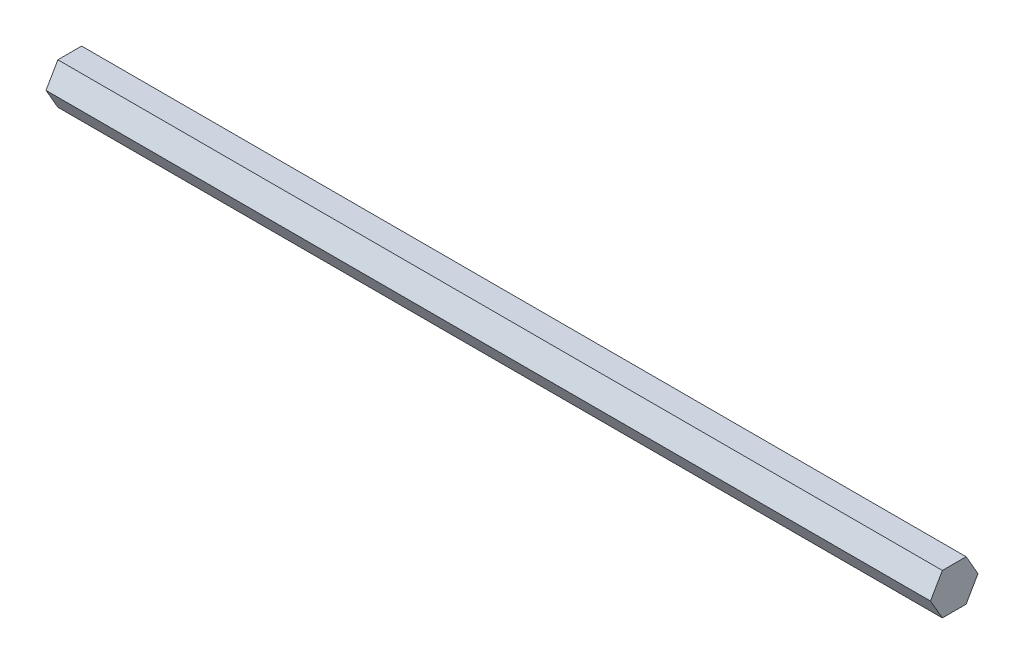
ISO-10303-21;
HEADER;
FILE_DESCRIPTION(('STEP AP214'),'2;1');
FILE_NAME('part.step','',(''),(''),'','','');
FILE_SCHEMA(('AUTOMOTIVE_DESIGN { 1 0 10303 214 1 1 1 1 }'));
ENDSEC;
DATA;
#1=APPLICATION_CONTEXT('core data for automotive mechanical design processes');
#2=APPLICATION_PROTOCOL_DEFINITION('international standard','automotive_design',2000,#1);
#3=PRODUCT_CONTEXT('',#1,'mechanical');
#4=PRODUCT('Part','Part','',(#3));
#5=PRODUCT_RELATED_PRODUCT_CATEGORY('part','',(#4));
#6=PRODUCT_DEFINITION_FORMATION('','',#4);
#7=PRODUCT_DEFINITION_CONTEXT('part definition',#1,'design');
#8=PRODUCT_DEFINITION('design','',#6,#7);
#9=PRODUCT_DEFINITION_SHAPE('','',#8);
#10=(LENGTH_UNIT() NAMED_UNIT(*) SI_UNIT(.MILLI.,.METRE.));
#11=(NAMED_UNIT(*) PLANE_ANGLE_UNIT() SI_UNIT($,.RADIAN.));
#12=(NAMED_UNIT(*) SI_UNIT($,.STERADIAN.) SOLID_ANGLE_UNIT());
#13=UNCERTAINTY_MEASURE_WITH_UNIT(LENGTH_MEASURE(1.E-05),#10,'distance_accuracy_value','');
#14=(GEOMETRIC_REPRESENTATION_CONTEXT(3) GLOBAL_UNCERTAINTY_ASSIGNED_CONTEXT((#13)) GLOBAL_UNIT_ASSIGNED_CONTEXT((#10,
#11,#12)) REPRESENTATION_CONTEXT('',''));
#15=CARTESIAN_POINT('',(0.,0.,0.));
#16=DIRECTION('',(0.,0.,1.));
#17=DIRECTION('',(1.,0.,0.));
#18=AXIS2_PLACEMENT_3D('',#15,#16,#17);
#19=CARTESIAN_POINT('',(273.05,-6.34999999999996,-3.6661742093542));
#20=DIRECTION('',(0.,0.499999999999995,0.866025403784442));
#21=DIRECTION('',(0.,-0.866025403784442,0.499999999999995));
#22=AXIS2_PLACEMENT_3D('',#19,#20,#21);
#23=PLANE('',#22);
#24=DIRECTION('',(0.,0.866025403784442,-0.499999999999995));
#25=VECTOR('',#24,1.);
#26=CARTESIAN_POINT('',(0.,-6.34999999999996,-3.6661742093542));
#27=LINE('',#26,#25);
#28=CARTESIAN_POINT('',(0.,-6.34999999999996,-3.6661742093542));
#29=VERTEX_POINT('',#28);
#30=CARTESIAN_POINT('',(0.,0.,-7.33234841870825));
#31=VERTEX_POINT('',#30);
#32=EDGE_CURVE('E123',#29,#31,#27,.T.);
#33=ORIENTED_EDGE('',*,*,#32,.T.);
#34=DIRECTION('',(-1.,0.,0.));
#35=VECTOR('',#34,1.);
#36=CARTESIAN_POINT('',(273.05,0.,-7.33234841870825));
#37=LINE('',#36,#35);
#38=CARTESIAN_POINT('',(273.05,0.,-7.33234841870825));
#39=VERTEX_POINT('',#38);
#40=EDGE_CURVE('E11',#39,#31,#37,.T.);
#41=ORIENTED_EDGE('',*,*,#40,.F.);
#42=DIRECTION('',(0.,0.866025403784442,-0.499999999999995));
#43=VECTOR('',#42,1.);
#44=CARTESIAN_POINT('',(273.05,-6.34999999999996,-3.6661742093542));
#45=LINE('',#44,#43);
#46=CARTESIAN_POINT('',(273.05,-6.34999999999996,-3.6661742093542));
#47=VERTEX_POINT('',#46);
#48=EDGE_CURVE('E133',#47,#39,#45,.T.);
#49=ORIENTED_EDGE('',*,*,#48,.F.);
#50=DIRECTION('',(-1.,0.,0.));
#51=VECTOR('',#50,1.);
#52=CARTESIAN_POINT('',(273.05,-6.34999999999996,-3.6661742093542));
#53=LINE('',#52,#51);
#54=EDGE_CURVE('E119',#47,#29,#53,.T.);
#55=ORIENTED_EDGE('',*,*,#54,.T.);
#56=EDGE_LOOP('',(#33,#41,#49,#55));
#57=FACE_BOUND('',#56,.T.);
#58=ADVANCED_FACE('F39',(#57),#23,.F.);
#59=CARTESIAN_POINT('',(273.05,0.,-7.33234841870825));
#60=DIRECTION('',(0.,-0.500000000000001,0.866025403784438));
#61=DIRECTION('',(0.,-0.866025403784438,-0.500000000000001));
#62=AXIS2_PLACEMENT_3D('',#59,#60,#61);
#63=PLANE('',#62);
#64=DIRECTION('',(0.,0.866025403784438,0.500000000000001));
#65=VECTOR('',#64,1.);
#66=CARTESIAN_POINT('',(0.,0.,-7.33234841870825));
#67=LINE('',#66,#65);
#68=CARTESIAN_POINT('',(0.,6.35000000000001,-3.66617420935411));
#69=VERTEX_POINT('',#68);
#70=EDGE_CURVE('E126',#31,#69,#67,.T.);
#71=ORIENTED_EDGE('',*,*,#70,.T.);
#72=DIRECTION('',(-1.,0.,0.));
#73=VECTOR('',#72,1.);
#74=CARTESIAN_POINT('',(273.05,6.35000000000001,-3.66617420935411));
#75=LINE('',#74,#73);
#76=CARTESIAN_POINT('',(273.05,6.35000000000001,-3.66617420935411));
#77=VERTEX_POINT('',#76);
#78=EDGE_CURVE('E47',#77,#69,#75,.T.);
#79=ORIENTED_EDGE('',*,*,#78,.F.);
#80=DIRECTION('',(0.,0.866025403784438,0.500000000000001));
#81=VECTOR('',#80,1.);
#82=CARTESIAN_POINT('',(273.05,0.,-7.33234841870825));
#83=LINE('',#82,#81);
#84=EDGE_CURVE('E92',#39,#77,#83,.T.);
#85=ORIENTED_EDGE('',*,*,#84,.F.);
#86=ORIENTED_EDGE('',*,*,#40,.T.);
#87=EDGE_LOOP('',(#71,#79,#85,#86));
#88=FACE_BOUND('',#87,.T.);
#89=ADVANCED_FACE('F157',(#88),#63,.F.);
#90=CARTESIAN_POINT('',(273.05,6.35000000000001,-3.66617420935411));
#91=DIRECTION('',(0.,-1.,0.));
#92=DIRECTION('',(0.,0.,-1.));
#93=AXIS2_PLACEMENT_3D('',#90,#91,#92);
#94=PLANE('',#93);
#95=DIRECTION('',(0.,0.,1.));
#96=VECTOR('',#95,1.);
#97=CARTESIAN_POINT('',(0.,6.35000000000001,-3.66617420935411));
#98=LINE('',#97,#96);
#99=CARTESIAN_POINT('',(0.,6.34999999999999,3.66617420935415));
#100=VERTEX_POINT('',#99);
#101=EDGE_CURVE('E128',#69,#100,#98,.T.);
#102=ORIENTED_EDGE('',*,*,#101,.T.);
#103=DIRECTION('',(-1.,0.,0.));
#104=VECTOR('',#103,1.);
#105=CARTESIAN_POINT('',(273.05,6.34999999999999,3.66617420935415));
#106=LINE('',#105,#104);
#107=CARTESIAN_POINT('',(273.05,6.34999999999999,3.66617420935415));
#108=VERTEX_POINT('',#107);
#109=EDGE_CURVE('E114',#108,#100,#106,.T.);
#110=ORIENTED_EDGE('',*,*,#109,.F.);
#111=DIRECTION('',(0.,0.,1.));
#112=VECTOR('',#111,1.);
#113=CARTESIAN_POINT('',(273.05,6.35000000000001,-3.66617420935411));
#114=LINE('',#113,#112);
#115=EDGE_CURVE('E105',#77,#108,#114,.T.);
#116=ORIENTED_EDGE('',*,*,#115,.F.);
#117=ORIENTED_EDGE('',*,*,#78,.T.);
#118=EDGE_LOOP('',(#102,#110,#116,#117));
#119=FACE_BOUND('',#118,.T.);
#120=ADVANCED_FACE('F139',(#119),#94,.F.);
#121=CARTESIAN_POINT('',(273.05,6.34999999999999,3.66617420935415));
#122=DIRECTION('',(0.,-0.499999999999995,-0.866025403784442));
#123=DIRECTION('',(0.,0.866025403784442,-0.499999999999995));
#124=AXIS2_PLACEMENT_3D('',#121,#122,#123);
#125=PLANE('',#124);
#126=DIRECTION('',(0.,-0.866025403784442,0.499999999999995));
#127=VECTOR('',#126,1.);
#128=CARTESIAN_POINT('',(0.,6.34999999999999,3.66617420935415));
#129=LINE('',#128,#127);
#130=CARTESIAN_POINT('',(0.,0.,7.33234841870825));
#131=VERTEX_POINT('',#130);
#132=EDGE_CURVE('E113',#100,#131,#129,.T.);
#133=ORIENTED_EDGE('',*,*,#132,.T.);
#134=DIRECTION('',(-1.,0.,0.));
#135=VECTOR('',#134,1.);
#136=CARTESIAN_POINT('',(273.05,0.,7.33234841870825));
#137=LINE('',#136,#135);
#138=CARTESIAN_POINT('',(273.05,0.,7.33234841870825));
#139=VERTEX_POINT('',#138);
#140=EDGE_CURVE('E110',#139,#131,#137,.T.);
#141=ORIENTED_EDGE('',*,*,#140,.F.);
#142=DIRECTION('',(0.,-0.866025403784442,0.499999999999995));
#143=VECTOR('',#142,1.);
#144=CARTESIAN_POINT('',(273.05,6.34999999999999,3.66617420935415));
#145=LINE('',#144,#143);
#146=EDGE_CURVE('E99',#108,#139,#145,.T.);
#147=ORIENTED_EDGE('',*,*,#146,.F.);
#148=ORIENTED_EDGE('',*,*,#109,.T.);
#149=EDGE_LOOP('',(#133,#141,#147,#148));
#150=FACE_BOUND('',#149,.T.);
#151=ADVANCED_FACE('F111',(#150),#125,.F.);
#152=CARTESIAN_POINT('',(273.05,0.,7.33234841870825));
#153=DIRECTION('',(0.,0.500000000000007,-0.866025403784435));
#154=DIRECTION('',(0.,0.866025403784435,0.500000000000007));
#155=AXIS2_PLACEMENT_3D('',#152,#153,#154);
#156=PLANE('',#155);
#157=DIRECTION('',(0.,-0.866025403784434,-0.500000000000007));
#158=VECTOR('',#157,1.);
#159=CARTESIAN_POINT('',(0.,0.,7.33234841870825));
#160=LINE('',#159,#158);
#161=CARTESIAN_POINT('',(0.,-6.35000000000004,3.66617420935407));
#162=VERTEX_POINT('',#161);
#163=EDGE_CURVE('E78',#131,#162,#160,.T.);
#164=ORIENTED_EDGE('',*,*,#163,.T.);
#165=DIRECTION('',(-1.,0.,0.));
#166=VECTOR('',#165,1.);
#167=CARTESIAN_POINT('',(273.05,-6.35000000000004,3.66617420935407));
#168=LINE('',#167,#166);
#169=CARTESIAN_POINT('',(273.05,-6.35000000000004,3.66617420935407));
#170=VERTEX_POINT('',#169);
#171=EDGE_CURVE('E115',#170,#162,#168,.T.);
#172=ORIENTED_EDGE('',*,*,#171,.F.);
#173=DIRECTION('',(0.,-0.866025403784434,-0.500000000000007));
#174=VECTOR('',#173,1.);
#175=CARTESIAN_POINT('',(273.05,0.,7.33234841870825));
#176=LINE('',#175,#174);
#177=EDGE_CURVE('E103',#139,#170,#176,.T.);
#178=ORIENTED_EDGE('',*,*,#177,.F.);
#179=ORIENTED_EDGE('',*,*,#140,.T.);
#180=EDGE_LOOP('',(#164,#172,#178,#179));
#181=FACE_BOUND('',#180,.T.);
#182=ADVANCED_FACE('F117',(#181),#156,.F.);
#183=CARTESIAN_POINT('',(273.05,-6.35000000000004,3.66617420935407));
#184=DIRECTION('',(0.,1.,0.));
#185=DIRECTION('',(0.,0.,1.));
#186=AXIS2_PLACEMENT_3D('',#183,#184,#185);
#187=PLANE('',#186);
#188=DIRECTION('',(0.,0.,-1.));
#189=VECTOR('',#188,1.);
#190=CARTESIAN_POINT('',(0.,-6.35000000000004,3.66617420935407));
#191=LINE('',#190,#189);
#192=EDGE_CURVE('E84',#162,#29,#191,.T.);
#193=ORIENTED_EDGE('',*,*,#192,.T.);
#194=ORIENTED_EDGE('',*,*,#54,.F.);
#195=DIRECTION('',(0.,0.,-1.));
#196=VECTOR('',#195,1.);
#197=CARTESIAN_POINT('',(273.05,-6.35000000000004,3.66617420935407));
#198=LINE('',#197,#196);
#199=EDGE_CURVE('E55',#170,#47,#198,.T.);
#200=ORIENTED_EDGE('',*,*,#199,.F.);
#201=ORIENTED_EDGE('',*,*,#171,.T.);
#202=EDGE_LOOP('',(#193,#194,#200,#201));
#203=FACE_BOUND('',#202,.T.);
#204=ADVANCED_FACE('F146',(#203),#187,.F.);
#205=CARTESIAN_POINT('',(273.05,0.,0.));
#206=DIRECTION('',(1.,0.,0.));
#207=DIRECTION('',(0.,0.,-1.));
#208=AXIS2_PLACEMENT_3D('',#205,#206,#207);
#209=PLANE('',#208);
#210=ORIENTED_EDGE('',*,*,#48,.T.);
#211=ORIENTED_EDGE('',*,*,#84,.T.);
#212=ORIENTED_EDGE('',*,*,#115,.T.);
#213=ORIENTED_EDGE('',*,*,#146,.T.);
#214=ORIENTED_EDGE('',*,*,#177,.T.);
#215=ORIENTED_EDGE('',*,*,#199,.T.);
#216=EDGE_LOOP('',(#210,#211,#212,#213,#214,#215));
#217=FACE_BOUND('',#216,.T.);
#218=ADVANCED_FACE('F101',(#217),#209,.T.);
#219=CARTESIAN_POINT('',(0.,0.,0.));
#220=DIRECTION('',(1.,0.,0.));
#221=DIRECTION('',(0.,0.,-1.));
#222=AXIS2_PLACEMENT_3D('',#219,#220,#221);
#223=PLANE('',#222);
#224=ORIENTED_EDGE('',*,*,#32,.F.);
#225=ORIENTED_EDGE('',*,*,#192,.F.);
#226=ORIENTED_EDGE('',*,*,#163,.F.);
#227=ORIENTED_EDGE('',*,*,#132,.F.);
#228=ORIENTED_EDGE('',*,*,#101,.F.);
#229=ORIENTED_EDGE('',*,*,#70,.F.);
#230=EDGE_LOOP('',(#224,#225,#226,#227,#228,#229));
#231=FACE_BOUND('',#230,.T.);
#232=ADVANCED_FACE('F142',(#231),#223,.F.);
#233=CLOSED_SHELL('',(#58,#89,#120,#151,#182,#204,#218,#232));
#234=MANIFOLD_SOLID_BREP('B2',#233);
#235=ADVANCED_BREP_SHAPE_REPRESENTATION('',(#18,#234),#14);
#236=SHAPE_DEFINITION_REPRESENTATION(#9,#235);
ENDSEC;
END-ISO-10303-21;
